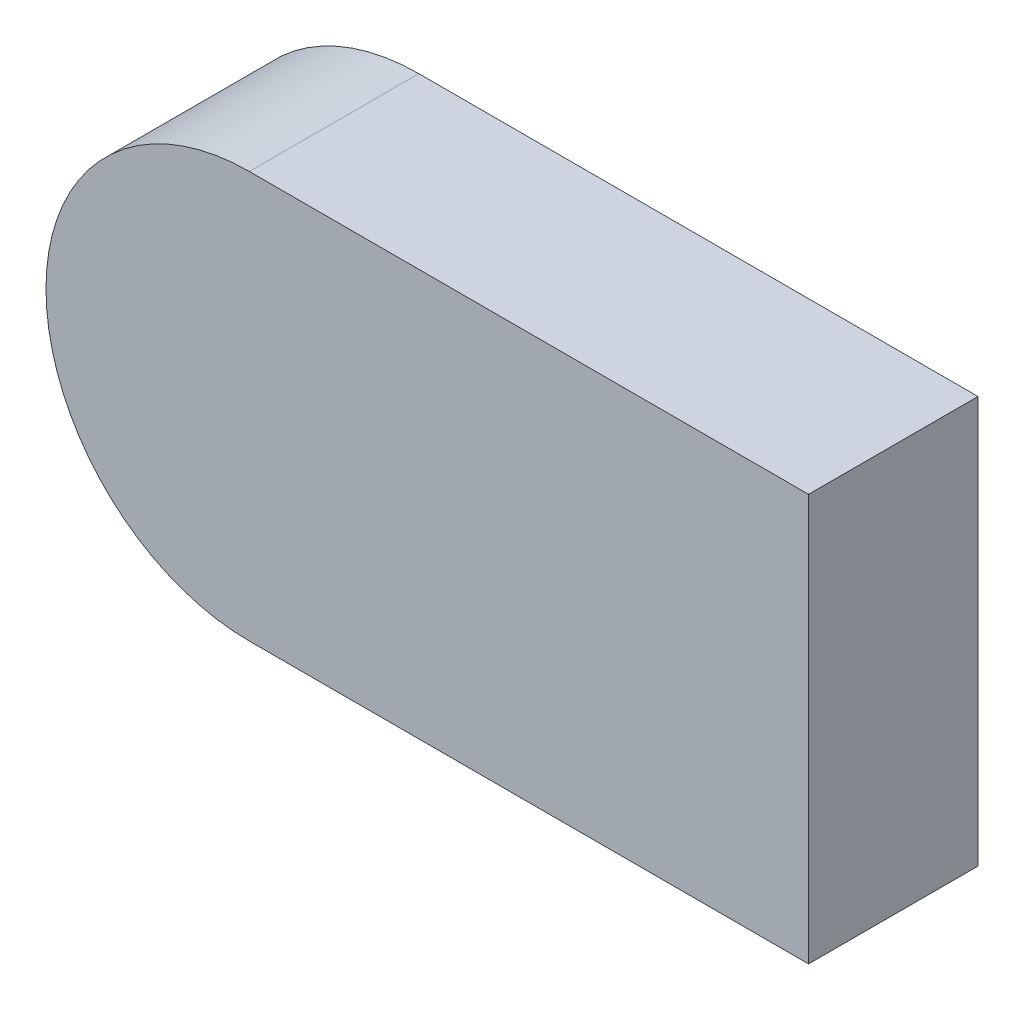
ISO-10303-21;
HEADER;
FILE_DESCRIPTION(('STEP AP214'),'2;1');
FILE_NAME('part.step','',(''),(''),'','','');
FILE_SCHEMA(('AUTOMOTIVE_DESIGN { 1 0 10303 214 1 1 1 1 }'));
ENDSEC;
DATA;
#1=APPLICATION_CONTEXT('core data for automotive mechanical design processes');
#2=APPLICATION_PROTOCOL_DEFINITION('international standard','automotive_design',2000,#1);
#3=PRODUCT_CONTEXT('',#1,'mechanical');
#4=PRODUCT('Part','Part','',(#3));
#5=PRODUCT_RELATED_PRODUCT_CATEGORY('part','',(#4));
#6=PRODUCT_DEFINITION_FORMATION('','',#4);
#7=PRODUCT_DEFINITION_CONTEXT('part definition',#1,'design');
#8=PRODUCT_DEFINITION('design','',#6,#7);
#9=PRODUCT_DEFINITION_SHAPE('','',#8);
#10=(LENGTH_UNIT() NAMED_UNIT(*) SI_UNIT(.MILLI.,.METRE.));
#11=(NAMED_UNIT(*) PLANE_ANGLE_UNIT() SI_UNIT($,.RADIAN.));
#12=(NAMED_UNIT(*) SI_UNIT($,.STERADIAN.) SOLID_ANGLE_UNIT());
#13=UNCERTAINTY_MEASURE_WITH_UNIT(LENGTH_MEASURE(1.E-05),#10,'distance_accuracy_value','');
#14=(GEOMETRIC_REPRESENTATION_CONTEXT(3) GLOBAL_UNCERTAINTY_ASSIGNED_CONTEXT((#13)) GLOBAL_UNIT_ASSIGNED_CONTEXT((#10,
#11,#12)) REPRESENTATION_CONTEXT('',''));
#15=CARTESIAN_POINT('',(0.,0.,0.));
#16=DIRECTION('',(0.,0.,1.));
#17=DIRECTION('',(1.,0.,0.));
#18=AXIS2_PLACEMENT_3D('',#15,#16,#17);
#19=CARTESIAN_POINT('',(4.05,3.13,0.));
#20=DIRECTION('',(0.,-1.,0.));
#21=DIRECTION('',(-1.,0.,0.));
#22=AXIS2_PLACEMENT_3D('',#19,#20,#21);
#23=PLANE('',#22);
#24=DIRECTION('',(0.,0.,1.));
#25=VECTOR('',#24,1.);
#26=CARTESIAN_POINT('',(4.05,3.13,0.));
#27=LINE('',#26,#25);
#28=CARTESIAN_POINT('',(4.05,3.13,0.));
#29=VERTEX_POINT('',#28);
#30=CARTESIAN_POINT('',(4.05,3.13,0.1));
#31=VERTEX_POINT('',#30);
#32=EDGE_CURVE('E11',#29,#31,#27,.T.);
#33=ORIENTED_EDGE('',*,*,#32,.T.);
#34=DIRECTION('',(-1.,0.,0.));
#35=VECTOR('',#34,1.);
#36=CARTESIAN_POINT('',(4.05,3.13,0.1));
#37=LINE('',#36,#35);
#38=CARTESIAN_POINT('',(3.72,3.13,0.1));
#39=VERTEX_POINT('',#38);
#40=EDGE_CURVE('E24',#31,#39,#37,.T.);
#41=ORIENTED_EDGE('',*,*,#40,.T.);
#42=DIRECTION('',(0.,0.,1.));
#43=VECTOR('',#42,1.);
#44=CARTESIAN_POINT('',(3.72,3.13,0.));
#45=LINE('',#44,#43);
#46=CARTESIAN_POINT('',(3.72,3.13,0.));
#47=VERTEX_POINT('',#46);
#48=EDGE_CURVE('E86',#47,#39,#45,.T.);
#49=ORIENTED_EDGE('',*,*,#48,.F.);
#50=DIRECTION('',(-1.,0.,0.));
#51=VECTOR('',#50,1.);
#52=CARTESIAN_POINT('',(4.05,3.13,0.));
#53=LINE('',#52,#51);
#54=EDGE_CURVE('E83',#29,#47,#53,.T.);
#55=ORIENTED_EDGE('',*,*,#54,.F.);
#56=EDGE_LOOP('',(#33,#41,#49,#55));
#57=FACE_BOUND('',#56,.T.);
#58=ADVANCED_FACE('F17',(#57),#23,.T.);
#59=CARTESIAN_POINT('',(3.72,3.25,0.));
#60=DIRECTION('',(0.,0.,-1.));
#61=DIRECTION('',(1.,0.,0.));
#62=AXIS2_PLACEMENT_3D('',#59,#60,#61);
#63=CYLINDRICAL_SURFACE('',#62,0.12);
#64=CARTESIAN_POINT('',(3.72,3.25,0.));
#65=DIRECTION('',(0.,0.,1.));
#66=DIRECTION('',(1.,0.,0.));
#67=AXIS2_PLACEMENT_3D('',#64,#65,#66);
#68=CIRCLE('',#67,0.12);
#69=CARTESIAN_POINT('',(3.72,3.37,0.));
#70=VERTEX_POINT('',#69);
#71=EDGE_CURVE('E80',#70,#47,#68,.T.);
#72=ORIENTED_EDGE('',*,*,#71,.T.);
#73=ORIENTED_EDGE('',*,*,#48,.T.);
#74=CARTESIAN_POINT('',(3.72,3.25,0.1));
#75=DIRECTION('',(0.,0.,1.));
#76=DIRECTION('',(1.,0.,0.));
#77=AXIS2_PLACEMENT_3D('',#74,#75,#76);
#78=CIRCLE('',#77,0.12);
#79=CARTESIAN_POINT('',(3.72,3.37,0.1));
#80=VERTEX_POINT('',#79);
#81=EDGE_CURVE('E78',#80,#39,#78,.T.);
#82=ORIENTED_EDGE('',*,*,#81,.F.);
#83=DIRECTION('',(0.,0.,1.));
#84=VECTOR('',#83,1.);
#85=CARTESIAN_POINT('',(3.72,3.37,0.));
#86=LINE('',#85,#84);
#87=EDGE_CURVE('E67',#70,#80,#86,.T.);
#88=ORIENTED_EDGE('',*,*,#87,.F.);
#89=EDGE_LOOP('',(#72,#73,#82,#88));
#90=FACE_BOUND('',#89,.T.);
#91=ADVANCED_FACE('F89',(#90),#63,.T.);
#92=CARTESIAN_POINT('',(4.05,3.37,0.));
#93=DIRECTION('',(0.,-1.,0.));
#94=DIRECTION('',(-1.,0.,0.));
#95=AXIS2_PLACEMENT_3D('',#92,#93,#94);
#96=PLANE('',#95);
#97=DIRECTION('',(-1.,0.,0.));
#98=VECTOR('',#97,1.);
#99=CARTESIAN_POINT('',(4.05,3.37,0.));
#100=LINE('',#99,#98);
#101=CARTESIAN_POINT('',(4.05,3.37,0.));
#102=VERTEX_POINT('',#101);
#103=EDGE_CURVE('E70',#102,#70,#100,.T.);
#104=ORIENTED_EDGE('',*,*,#103,.T.);
#105=ORIENTED_EDGE('',*,*,#87,.T.);
#106=DIRECTION('',(-1.,0.,0.));
#107=VECTOR('',#106,1.);
#108=CARTESIAN_POINT('',(4.05,3.37,0.1));
#109=LINE('',#108,#107);
#110=CARTESIAN_POINT('',(4.05,3.37,0.1));
#111=VERTEX_POINT('',#110);
#112=EDGE_CURVE('E61',#111,#80,#109,.T.);
#113=ORIENTED_EDGE('',*,*,#112,.F.);
#114=DIRECTION('',(0.,0.,1.));
#115=VECTOR('',#114,1.);
#116=CARTESIAN_POINT('',(4.05,3.37,0.));
#117=LINE('',#116,#115);
#118=EDGE_CURVE('E51',#102,#111,#117,.T.);
#119=ORIENTED_EDGE('',*,*,#118,.F.);
#120=EDGE_LOOP('',(#104,#105,#113,#119));
#121=FACE_BOUND('',#120,.T.);
#122=ADVANCED_FACE('F65',(#121),#96,.F.);
#123=CARTESIAN_POINT('',(4.05,3.13,0.));
#124=DIRECTION('',(-1.,0.,0.));
#125=DIRECTION('',(0.,1.,0.));
#126=AXIS2_PLACEMENT_3D('',#123,#124,#125);
#127=PLANE('',#126);
#128=DIRECTION('',(0.,1.,0.));
#129=VECTOR('',#128,1.);
#130=CARTESIAN_POINT('',(4.05,3.13,0.));
#131=LINE('',#130,#129);
#132=EDGE_CURVE('E57',#29,#102,#131,.T.);
#133=ORIENTED_EDGE('',*,*,#132,.T.);
#134=ORIENTED_EDGE('',*,*,#118,.T.);
#135=DIRECTION('',(0.,1.,0.));
#136=VECTOR('',#135,1.);
#137=CARTESIAN_POINT('',(4.05,3.13,0.1));
#138=LINE('',#137,#136);
#139=EDGE_CURVE('E55',#31,#111,#138,.T.);
#140=ORIENTED_EDGE('',*,*,#139,.F.);
#141=ORIENTED_EDGE('',*,*,#32,.F.);
#142=EDGE_LOOP('',(#133,#134,#140,#141));
#143=FACE_BOUND('',#142,.T.);
#144=ADVANCED_FACE('F53',(#143),#127,.F.);
#145=CARTESIAN_POINT('',(3.849490847913,3.25,0.));
#146=DIRECTION('',(0.,0.,-1.));
#147=DIRECTION('',(-1.,0.,0.));
#148=AXIS2_PLACEMENT_3D('',#145,#146,#147);
#149=PLANE('',#148);
#150=ORIENTED_EDGE('',*,*,#54,.T.);
#151=ORIENTED_EDGE('',*,*,#71,.F.);
#152=ORIENTED_EDGE('',*,*,#103,.F.);
#153=ORIENTED_EDGE('',*,*,#132,.F.);
#154=EDGE_LOOP('',(#150,#151,#152,#153));
#155=FACE_BOUND('',#154,.T.);
#156=ADVANCED_FACE('F91',(#155),#149,.T.);
#157=CARTESIAN_POINT('',(3.849490847913,3.25,0.1));
#158=DIRECTION('',(0.,0.,-1.));
#159=DIRECTION('',(-1.,0.,0.));
#160=AXIS2_PLACEMENT_3D('',#157,#158,#159);
#161=PLANE('',#160);
#162=ORIENTED_EDGE('',*,*,#139,.T.);
#163=ORIENTED_EDGE('',*,*,#112,.T.);
#164=ORIENTED_EDGE('',*,*,#81,.T.);
#165=ORIENTED_EDGE('',*,*,#40,.F.);
#166=EDGE_LOOP('',(#162,#163,#164,#165));
#167=FACE_BOUND('',#166,.T.);
#168=ADVANCED_FACE('F72',(#167),#161,.F.);
#169=CLOSED_SHELL('',(#58,#91,#122,#144,#156,#168));
#170=MANIFOLD_SOLID_BREP('B1',#169);
#171=ADVANCED_BREP_SHAPE_REPRESENTATION('',(#18,#170),#14);
#172=SHAPE_DEFINITION_REPRESENTATION(#9,#171);
ENDSEC;
END-ISO-10303-21;
